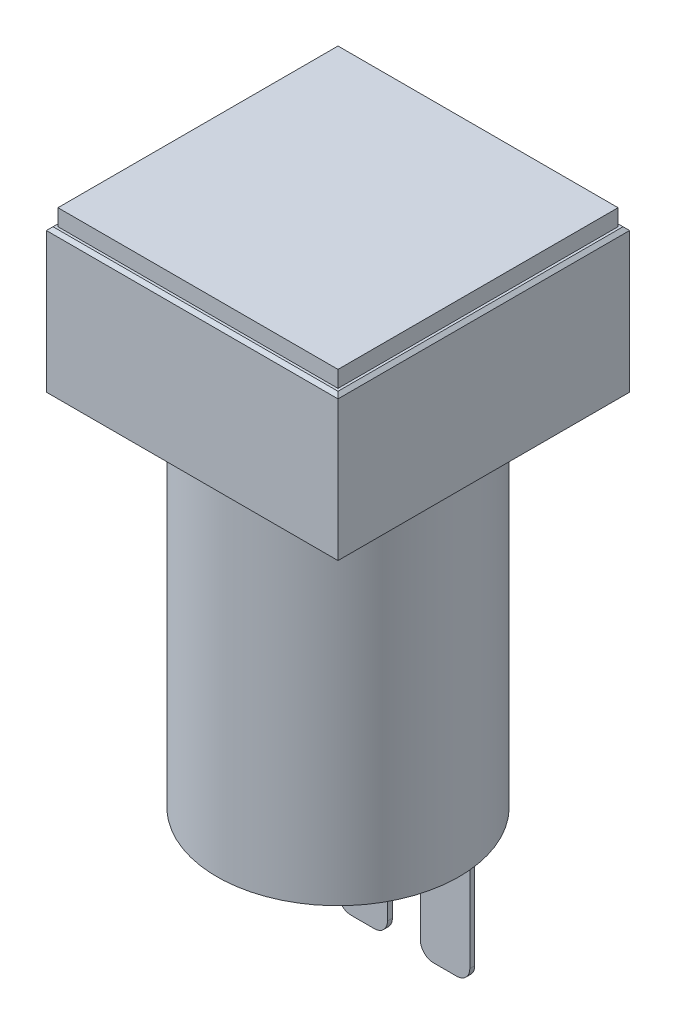
ISO-10303-21;
HEADER;
FILE_DESCRIPTION(('STEP AP214'),'2;1');
FILE_NAME('part.step','',(''),(''),'','','');
FILE_SCHEMA(('AUTOMOTIVE_DESIGN { 1 0 10303 214 1 1 1 1 }'));
ENDSEC;
DATA;
#1=APPLICATION_CONTEXT('core data for automotive mechanical design processes');
#2=APPLICATION_PROTOCOL_DEFINITION('international standard','automotive_design',2000,#1);
#3=PRODUCT_CONTEXT('',#1,'mechanical');
#4=PRODUCT('Part','Part','',(#3));
#5=PRODUCT_RELATED_PRODUCT_CATEGORY('part','',(#4));
#6=PRODUCT_DEFINITION_FORMATION('','',#4);
#7=PRODUCT_DEFINITION_CONTEXT('part definition',#1,'design');
#8=PRODUCT_DEFINITION('design','',#6,#7);
#9=PRODUCT_DEFINITION_SHAPE('','',#8);
#10=(LENGTH_UNIT() NAMED_UNIT(*) SI_UNIT(.MILLI.,.METRE.));
#11=(NAMED_UNIT(*) PLANE_ANGLE_UNIT() SI_UNIT($,.RADIAN.));
#12=(NAMED_UNIT(*) SI_UNIT($,.STERADIAN.) SOLID_ANGLE_UNIT());
#13=UNCERTAINTY_MEASURE_WITH_UNIT(LENGTH_MEASURE(1.E-05),#10,'distance_accuracy_value','');
#14=(GEOMETRIC_REPRESENTATION_CONTEXT(3) GLOBAL_UNCERTAINTY_ASSIGNED_CONTEXT((#13)) GLOBAL_UNIT_ASSIGNED_CONTEXT((#10,
#11,#12)) REPRESENTATION_CONTEXT('',''));
#15=CARTESIAN_POINT('',(0.,0.,0.));
#16=DIRECTION('',(0.,0.,1.));
#17=DIRECTION('',(1.,0.,0.));
#18=AXIS2_PLACEMENT_3D('',#15,#16,#17);
#19=CARTESIAN_POINT('',(0.,-21.8,0.));
#20=DIRECTION('',(0.,-1.,0.));
#21=DIRECTION('',(0.,0.,-1.));
#22=AXIS2_PLACEMENT_3D('',#19,#20,#21);
#23=PLANE('',#22);
#24=CARTESIAN_POINT('',(0.,-21.8,0.));
#25=DIRECTION('',(0.,-1.,0.));
#26=DIRECTION('',(0.,0.,-1.));
#27=AXIS2_PLACEMENT_3D('',#24,#25,#26);
#28=CIRCLE('',#27,7.35);
#29=CARTESIAN_POINT('',(0.,-21.8,-7.35));
#30=VERTEX_POINT('',#29);
#31=EDGE_CURVE('E372',#30,#30,#28,.T.);
#32=ORIENTED_EDGE('',*,*,#31,.T.);
#33=EDGE_LOOP('',(#32));
#34=FACE_BOUND('',#33,.T.);
#35=DIRECTION('',(1.,0.,0.));
#36=VECTOR('',#35,1.);
#37=CARTESIAN_POINT('',(-6.5,-21.8,-1.8));
#38=LINE('',#37,#36);
#39=CARTESIAN_POINT('',(-6.5,-21.8,-1.8));
#40=VERTEX_POINT('',#39);
#41=CARTESIAN_POINT('',(-3.5,-21.8,-1.8));
#42=VERTEX_POINT('',#41);
#43=EDGE_CURVE('E350',#40,#42,#38,.T.);
#44=ORIENTED_EDGE('',*,*,#43,.F.);
#45=DIRECTION('',(0.,0.,-1.));
#46=VECTOR('',#45,1.);
#47=CARTESIAN_POINT('',(-6.5,-21.8,-1.5));
#48=LINE('',#47,#46);
#49=CARTESIAN_POINT('',(-6.5,-21.8,-1.5));
#50=VERTEX_POINT('',#49);
#51=EDGE_CURVE('E336',#50,#40,#48,.T.);
#52=ORIENTED_EDGE('',*,*,#51,.F.);
#53=DIRECTION('',(-1.,0.,0.));
#54=VECTOR('',#53,1.);
#55=CARTESIAN_POINT('',(-6.5,-21.8,-1.5));
#56=LINE('',#55,#54);
#57=CARTESIAN_POINT('',(-3.5,-21.8,-1.5));
#58=VERTEX_POINT('',#57);
#59=EDGE_CURVE('E342',#58,#50,#56,.T.);
#60=ORIENTED_EDGE('',*,*,#59,.F.);
#61=DIRECTION('',(0.,0.,1.));
#62=VECTOR('',#61,1.);
#63=CARTESIAN_POINT('',(-3.5,-21.8,-1.5));
#64=LINE('',#63,#62);
#65=EDGE_CURVE('E354',#42,#58,#64,.T.);
#66=ORIENTED_EDGE('',*,*,#65,.F.);
#67=EDGE_LOOP('',(#44,#52,#60,#66));
#68=FACE_BOUND('',#67,.T.);
#69=DIRECTION('',(1.,0.,0.));
#70=VECTOR('',#69,1.);
#71=CARTESIAN_POINT('',(-1.5,-21.8,-1.8));
#72=LINE('',#71,#70);
#73=CARTESIAN_POINT('',(-1.5,-21.8,-1.8));
#74=VERTEX_POINT('',#73);
#75=CARTESIAN_POINT('',(1.5,-21.8,-1.8));
#76=VERTEX_POINT('',#75);
#77=EDGE_CURVE('E314',#74,#76,#72,.T.);
#78=ORIENTED_EDGE('',*,*,#77,.F.);
#79=DIRECTION('',(0.,0.,-1.));
#80=VECTOR('',#79,1.);
#81=CARTESIAN_POINT('',(-1.5,-21.8,-1.8));
#82=LINE('',#81,#80);
#83=CARTESIAN_POINT('',(-1.5,-21.8,-1.5));
#84=VERTEX_POINT('',#83);
#85=EDGE_CURVE('E300',#84,#74,#82,.T.);
#86=ORIENTED_EDGE('',*,*,#85,.F.);
#87=DIRECTION('',(-1.,0.,0.));
#88=VECTOR('',#87,1.);
#89=CARTESIAN_POINT('',(-1.5,-21.8,-1.5));
#90=LINE('',#89,#88);
#91=CARTESIAN_POINT('',(1.5,-21.8,-1.5));
#92=VERTEX_POINT('',#91);
#93=EDGE_CURVE('E306',#92,#84,#90,.T.);
#94=ORIENTED_EDGE('',*,*,#93,.F.);
#95=DIRECTION('',(0.,0.,1.));
#96=VECTOR('',#95,1.);
#97=CARTESIAN_POINT('',(1.5,-21.8,-1.8));
#98=LINE('',#97,#96);
#99=EDGE_CURVE('E318',#76,#92,#98,.T.);
#100=ORIENTED_EDGE('',*,*,#99,.F.);
#101=EDGE_LOOP('',(#78,#86,#94,#100));
#102=FACE_BOUND('',#101,.T.);
#103=DIRECTION('',(1.,0.,0.));
#104=VECTOR('',#103,1.);
#105=CARTESIAN_POINT('',(3.5,-21.8,-1.8));
#106=LINE('',#105,#104);
#107=CARTESIAN_POINT('',(3.5,-21.8,-1.8));
#108=VERTEX_POINT('',#107);
#109=CARTESIAN_POINT('',(6.5,-21.8,-1.8));
#110=VERTEX_POINT('',#109);
#111=EDGE_CURVE('E263',#108,#110,#106,.T.);
#112=ORIENTED_EDGE('',*,*,#111,.F.);
#113=DIRECTION('',(0.,0.,-1.));
#114=VECTOR('',#113,1.);
#115=CARTESIAN_POINT('',(3.5,-21.8,-1.5));
#116=LINE('',#115,#114);
#117=CARTESIAN_POINT('',(3.5,-21.8,-1.5));
#118=VERTEX_POINT('',#117);
#119=EDGE_CURVE('E258',#118,#108,#116,.T.);
#120=ORIENTED_EDGE('',*,*,#119,.F.);
#121=DIRECTION('',(-1.,0.,0.));
#122=VECTOR('',#121,1.);
#123=CARTESIAN_POINT('',(3.5,-21.8,-1.5));
#124=LINE('',#123,#122);
#125=CARTESIAN_POINT('',(6.5,-21.8,-1.5));
#126=VERTEX_POINT('',#125);
#127=EDGE_CURVE('E274',#126,#118,#124,.T.);
#128=ORIENTED_EDGE('',*,*,#127,.F.);
#129=DIRECTION('',(0.,0.,1.));
#130=VECTOR('',#129,1.);
#131=CARTESIAN_POINT('',(6.5,-21.8,-1.5));
#132=LINE('',#131,#130);
#133=EDGE_CURVE('E282',#110,#126,#132,.T.);
#134=ORIENTED_EDGE('',*,*,#133,.F.);
#135=EDGE_LOOP('',(#112,#120,#128,#134));
#136=FACE_BOUND('',#135,.T.);
#137=ADVANCED_FACE('F43',(#34,#68,#102,#136),#23,.T.);
#138=CARTESIAN_POINT('',(8.85,8.7,-8.85));
#139=DIRECTION('',(-1.,0.,0.));
#140=DIRECTION('',(0.,0.,1.));
#141=AXIS2_PLACEMENT_3D('',#138,#139,#140);
#142=PLANE('',#141);
#143=DIRECTION('',(0.,-1.,0.));
#144=VECTOR('',#143,1.);
#145=CARTESIAN_POINT('',(8.85,8.7,-8.85));
#146=LINE('',#145,#144);
#147=CARTESIAN_POINT('',(8.85,8.5,-8.85));
#148=VERTEX_POINT('',#147);
#149=CARTESIAN_POINT('',(8.85,0.,-8.85));
#150=VERTEX_POINT('',#149);
#151=EDGE_CURVE('E382',#148,#150,#146,.T.);
#152=ORIENTED_EDGE('',*,*,#151,.F.);
#153=DIRECTION('',(0.,0.,1.));
#154=VECTOR('',#153,1.);
#155=CARTESIAN_POINT('',(8.85,8.5,8.85));
#156=LINE('',#155,#154);
#157=CARTESIAN_POINT('',(8.85,8.5,8.85));
#158=VERTEX_POINT('',#157);
#159=EDGE_CURVE('E503',#148,#158,#156,.T.);
#160=ORIENTED_EDGE('',*,*,#159,.T.);
#161=DIRECTION('',(0.,-1.,0.));
#162=VECTOR('',#161,1.);
#163=CARTESIAN_POINT('',(8.85,8.7,8.85));
#164=LINE('',#163,#162);
#165=CARTESIAN_POINT('',(8.85,0.,8.85));
#166=VERTEX_POINT('',#165);
#167=EDGE_CURVE('E398',#158,#166,#164,.T.);
#168=ORIENTED_EDGE('',*,*,#167,.T.);
#169=DIRECTION('',(0.,0.,-1.));
#170=VECTOR('',#169,1.);
#171=CARTESIAN_POINT('',(8.85,0.,-8.85));
#172=LINE('',#171,#170);
#173=EDGE_CURVE('E376',#166,#150,#172,.T.);
#174=ORIENTED_EDGE('',*,*,#173,.T.);
#175=EDGE_LOOP('',(#152,#160,#168,#174));
#176=FACE_BOUND('',#175,.T.);
#177=ADVANCED_FACE('F568',(#176),#142,.F.);
#178=CARTESIAN_POINT('',(-8.85,8.7,-8.85));
#179=DIRECTION('',(0.,0.,1.));
#180=DIRECTION('',(1.,0.,0.));
#181=AXIS2_PLACEMENT_3D('',#178,#179,#180);
#182=PLANE('',#181);
#183=DIRECTION('',(0.,-1.,0.));
#184=VECTOR('',#183,1.);
#185=CARTESIAN_POINT('',(-8.85,8.7,-8.85));
#186=LINE('',#185,#184);
#187=CARTESIAN_POINT('',(-8.85,8.5,-8.85));
#188=VERTEX_POINT('',#187);
#189=CARTESIAN_POINT('',(-8.85,0.,-8.85));
#190=VERTEX_POINT('',#189);
#191=EDGE_CURVE('E404',#188,#190,#186,.T.);
#192=ORIENTED_EDGE('',*,*,#191,.F.);
#193=DIRECTION('',(1.,0.,0.));
#194=VECTOR('',#193,1.);
#195=CARTESIAN_POINT('',(8.85,8.5,-8.85));
#196=LINE('',#195,#194);
#197=EDGE_CURVE('E54',#188,#148,#196,.T.);
#198=ORIENTED_EDGE('',*,*,#197,.T.);
#199=ORIENTED_EDGE('',*,*,#151,.T.);
#200=DIRECTION('',(-1.,0.,0.));
#201=VECTOR('',#200,1.);
#202=CARTESIAN_POINT('',(-8.85,0.,-8.85));
#203=LINE('',#202,#201);
#204=EDGE_CURVE('E386',#150,#190,#203,.T.);
#205=ORIENTED_EDGE('',*,*,#204,.T.);
#206=EDGE_LOOP('',(#192,#198,#199,#205));
#207=FACE_BOUND('',#206,.T.);
#208=ADVANCED_FACE('F574',(#207),#182,.F.);
#209=CARTESIAN_POINT('',(-8.85,8.7,-8.85));
#210=DIRECTION('',(1.,0.,0.));
#211=DIRECTION('',(0.,0.,-1.));
#212=AXIS2_PLACEMENT_3D('',#209,#210,#211);
#213=PLANE('',#212);
#214=DIRECTION('',(0.,-1.,0.));
#215=VECTOR('',#214,1.);
#216=CARTESIAN_POINT('',(-8.85,8.7,8.85));
#217=LINE('',#216,#215);
#218=CARTESIAN_POINT('',(-8.85,8.5,8.85));
#219=VERTEX_POINT('',#218);
#220=CARTESIAN_POINT('',(-8.85,0.,8.85));
#221=VERTEX_POINT('',#220);
#222=EDGE_CURVE('E401',#219,#221,#217,.T.);
#223=ORIENTED_EDGE('',*,*,#222,.F.);
#224=DIRECTION('',(0.,0.,-1.));
#225=VECTOR('',#224,1.);
#226=CARTESIAN_POINT('',(-8.85,8.5,-8.85));
#227=LINE('',#226,#225);
#228=EDGE_CURVE('E11',#219,#188,#227,.T.);
#229=ORIENTED_EDGE('',*,*,#228,.T.);
#230=ORIENTED_EDGE('',*,*,#191,.T.);
#231=DIRECTION('',(0.,0.,1.));
#232=VECTOR('',#231,1.);
#233=CARTESIAN_POINT('',(-8.85,0.,-8.85));
#234=LINE('',#233,#232);
#235=EDGE_CURVE('E390',#190,#221,#234,.T.);
#236=ORIENTED_EDGE('',*,*,#235,.T.);
#237=EDGE_LOOP('',(#223,#229,#230,#236));
#238=FACE_BOUND('',#237,.T.);
#239=ADVANCED_FACE('F563',(#238),#213,.F.);
#240=CARTESIAN_POINT('',(-8.85,8.7,8.85));
#241=DIRECTION('',(0.,0.,-1.));
#242=DIRECTION('',(-1.,0.,0.));
#243=AXIS2_PLACEMENT_3D('',#240,#241,#242);
#244=PLANE('',#243);
#245=ORIENTED_EDGE('',*,*,#167,.F.);
#246=DIRECTION('',(-1.,0.,0.));
#247=VECTOR('',#246,1.);
#248=CARTESIAN_POINT('',(-8.85,8.5,8.85));
#249=LINE('',#248,#247);
#250=EDGE_CURVE('E499',#158,#219,#249,.T.);
#251=ORIENTED_EDGE('',*,*,#250,.T.);
#252=ORIENTED_EDGE('',*,*,#222,.T.);
#253=DIRECTION('',(1.,0.,0.));
#254=VECTOR('',#253,1.);
#255=CARTESIAN_POINT('',(-8.85,0.,8.85));
#256=LINE('',#255,#254);
#257=EDGE_CURVE('E394',#221,#166,#256,.T.);
#258=ORIENTED_EDGE('',*,*,#257,.T.);
#259=EDGE_LOOP('',(#245,#251,#252,#258));
#260=FACE_BOUND('',#259,.T.);
#261=ADVANCED_FACE('F553',(#260),#244,.F.);
#262=CARTESIAN_POINT('',(0.,8.7,0.));
#263=DIRECTION('',(0.,1.,0.));
#264=DIRECTION('',(0.,0.,1.));
#265=AXIS2_PLACEMENT_3D('',#262,#263,#264);
#266=PLANE('',#265);
#267=DIRECTION('',(0.,0.,1.));
#268=VECTOR('',#267,1.);
#269=CARTESIAN_POINT('',(-8.65,8.7,8.85));
#270=LINE('',#269,#268);
#271=CARTESIAN_POINT('',(-8.65,8.7,-8.65));
#272=VERTEX_POINT('',#271);
#273=CARTESIAN_POINT('',(-8.65,8.7,8.65));
#274=VERTEX_POINT('',#273);
#275=EDGE_CURVE('E486',#272,#274,#270,.T.);
#276=ORIENTED_EDGE('',*,*,#275,.T.);
#277=DIRECTION('',(1.,0.,0.));
#278=VECTOR('',#277,1.);
#279=CARTESIAN_POINT('',(8.85,8.7,8.65));
#280=LINE('',#279,#278);
#281=CARTESIAN_POINT('',(8.65,8.7,8.65));
#282=VERTEX_POINT('',#281);
#283=EDGE_CURVE('E495',#274,#282,#280,.T.);
#284=ORIENTED_EDGE('',*,*,#283,.T.);
#285=DIRECTION('',(0.,0.,-1.));
#286=VECTOR('',#285,1.);
#287=CARTESIAN_POINT('',(8.65,8.7,-8.85));
#288=LINE('',#287,#286);
#289=CARTESIAN_POINT('',(8.65,8.7,-8.65));
#290=VERTEX_POINT('',#289);
#291=EDGE_CURVE('E492',#282,#290,#288,.T.);
#292=ORIENTED_EDGE('',*,*,#291,.T.);
#293=DIRECTION('',(-1.,0.,0.));
#294=VECTOR('',#293,1.);
#295=CARTESIAN_POINT('',(-8.85,8.7,-8.65));
#296=LINE('',#295,#294);
#297=EDGE_CURVE('E489',#290,#272,#296,.T.);
#298=ORIENTED_EDGE('',*,*,#297,.T.);
#299=EDGE_LOOP('',(#276,#284,#292,#298));
#300=FACE_BOUND('',#299,.T.);
#301=DIRECTION('',(0.,0.,-1.));
#302=VECTOR('',#301,1.);
#303=CARTESIAN_POINT('',(8.5,8.7,-8.5));
#304=LINE('',#303,#302);
#305=CARTESIAN_POINT('',(8.5,8.7,8.5));
#306=VERTEX_POINT('',#305);
#307=CARTESIAN_POINT('',(8.5,8.7,-8.5));
#308=VERTEX_POINT('',#307);
#309=EDGE_CURVE('E256',#306,#308,#304,.T.);
#310=ORIENTED_EDGE('',*,*,#309,.F.);
#311=DIRECTION('',(1.,0.,0.));
#312=VECTOR('',#311,1.);
#313=CARTESIAN_POINT('',(-8.5,8.7,8.5));
#314=LINE('',#313,#312);
#315=CARTESIAN_POINT('',(-8.5,8.7,8.5));
#316=VERTEX_POINT('',#315);
#317=EDGE_CURVE('E253',#316,#306,#314,.T.);
#318=ORIENTED_EDGE('',*,*,#317,.F.);
#319=DIRECTION('',(0.,0.,1.));
#320=VECTOR('',#319,1.);
#321=CARTESIAN_POINT('',(-8.5,8.7,-8.5));
#322=LINE('',#321,#320);
#323=CARTESIAN_POINT('',(-8.5,8.7,-8.5));
#324=VERTEX_POINT('',#323);
#325=EDGE_CURVE('E529',#324,#316,#322,.T.);
#326=ORIENTED_EDGE('',*,*,#325,.F.);
#327=DIRECTION('',(-1.,0.,0.));
#328=VECTOR('',#327,1.);
#329=CARTESIAN_POINT('',(-8.5,8.7,-8.5));
#330=LINE('',#329,#328);
#331=EDGE_CURVE('E526',#308,#324,#330,.T.);
#332=ORIENTED_EDGE('',*,*,#331,.F.);
#333=EDGE_LOOP('',(#310,#318,#326,#332));
#334=FACE_BOUND('',#333,.T.);
#335=ADVANCED_FACE('F550',(#300,#334),#266,.T.);
#336=CARTESIAN_POINT('',(0.,0.,0.));
#337=DIRECTION('',(0.,1.,0.));
#338=DIRECTION('',(0.,0.,1.));
#339=AXIS2_PLACEMENT_3D('',#336,#337,#338);
#340=PLANE('',#339);
#341=CARTESIAN_POINT('',(0.,0.,0.));
#342=DIRECTION('',(0.,-1.,0.));
#343=DIRECTION('',(0.,0.,-1.));
#344=AXIS2_PLACEMENT_3D('',#341,#342,#343);
#345=CIRCLE('',#344,7.35);
#346=CARTESIAN_POINT('',(0.,0.,-7.35));
#347=VERTEX_POINT('',#346);
#348=EDGE_CURVE('E377',#347,#347,#345,.T.);
#349=ORIENTED_EDGE('',*,*,#348,.F.);
#350=EDGE_LOOP('',(#349));
#351=FACE_BOUND('',#350,.T.);
#352=ORIENTED_EDGE('',*,*,#173,.F.);
#353=ORIENTED_EDGE('',*,*,#257,.F.);
#354=ORIENTED_EDGE('',*,*,#235,.F.);
#355=ORIENTED_EDGE('',*,*,#204,.F.);
#356=EDGE_LOOP('',(#352,#353,#354,#355));
#357=FACE_BOUND('',#356,.T.);
#358=ADVANCED_FACE('F552',(#351,#357),#340,.F.);
#359=CARTESIAN_POINT('',(0.,-21.8,0.));
#360=DIRECTION('',(0.,1.,0.));
#361=DIRECTION('',(0.,0.,1.));
#362=AXIS2_PLACEMENT_3D('',#359,#360,#361);
#363=CYLINDRICAL_SURFACE('',#362,7.35);
#364=ORIENTED_EDGE('',*,*,#31,.F.);
#365=EDGE_LOOP('',(#364));
#366=FACE_BOUND('',#365,.T.);
#367=ORIENTED_EDGE('',*,*,#348,.T.);
#368=EDGE_LOOP('',(#367));
#369=FACE_BOUND('',#368,.T.);
#370=ADVANCED_FACE('F560',(#366,#369),#363,.T.);
#371=CARTESIAN_POINT('',(-6.5,-28.6,-1.5));
#372=DIRECTION('',(1.,0.,0.));
#373=DIRECTION('',(0.,0.,-1.));
#374=AXIS2_PLACEMENT_3D('',#371,#372,#373);
#375=PLANE('',#374);
#376=DIRECTION('',(0.,1.,0.));
#377=VECTOR('',#376,1.);
#378=CARTESIAN_POINT('',(-6.5,-28.6,-1.8));
#379=LINE('',#378,#377);
#380=CARTESIAN_POINT('',(-6.5,-27.8,-1.8));
#381=VERTEX_POINT('',#380);
#382=EDGE_CURVE('E369',#381,#40,#379,.T.);
#383=ORIENTED_EDGE('',*,*,#382,.F.);
#384=DIRECTION('',(0.,0.,-1.));
#385=VECTOR('',#384,1.);
#386=CARTESIAN_POINT('',(-6.5,-27.8,-1.5));
#387=LINE('',#386,#385);
#388=CARTESIAN_POINT('',(-6.5,-27.8,-1.5));
#389=VERTEX_POINT('',#388);
#390=EDGE_CURVE('E483',#381,#389,#387,.F.);
#391=ORIENTED_EDGE('',*,*,#390,.T.);
#392=DIRECTION('',(0.,1.,0.));
#393=VECTOR('',#392,1.);
#394=CARTESIAN_POINT('',(-6.5,-28.6,-1.5));
#395=LINE('',#394,#393);
#396=EDGE_CURVE('E346',#389,#50,#395,.T.);
#397=ORIENTED_EDGE('',*,*,#396,.T.);
#398=ORIENTED_EDGE('',*,*,#51,.T.);
#399=EDGE_LOOP('',(#383,#391,#397,#398));
#400=FACE_BOUND('',#399,.T.);
#401=ADVANCED_FACE('F579',(#400),#375,.F.);
#402=CARTESIAN_POINT('',(-6.5,-28.6,-1.8));
#403=DIRECTION('',(0.,0.,1.));
#404=DIRECTION('',(1.,0.,0.));
#405=AXIS2_PLACEMENT_3D('',#402,#403,#404);
#406=PLANE('',#405);
#407=DIRECTION('',(0.,1.,0.));
#408=VECTOR('',#407,1.);
#409=CARTESIAN_POINT('',(-3.5,-28.6,-1.8));
#410=LINE('',#409,#408);
#411=CARTESIAN_POINT('',(-3.5,-27.8,-1.8));
#412=VERTEX_POINT('',#411);
#413=EDGE_CURVE('E366',#412,#42,#410,.T.);
#414=ORIENTED_EDGE('',*,*,#413,.F.);
#415=CARTESIAN_POINT('',(-4.3,-27.8,-1.8));
#416=DIRECTION('',(0.,0.,1.));
#417=DIRECTION('',(1.,0.,0.));
#418=AXIS2_PLACEMENT_3D('',#415,#416,#417);
#419=CIRCLE('',#418,0.8);
#420=CARTESIAN_POINT('',(-4.3,-28.6,-1.8));
#421=VERTEX_POINT('',#420);
#422=EDGE_CURVE('E480',#412,#421,#419,.F.);
#423=ORIENTED_EDGE('',*,*,#422,.T.);
#424=DIRECTION('',(1.,0.,0.));
#425=VECTOR('',#424,1.);
#426=CARTESIAN_POINT('',(-6.5,-28.6,-1.8));
#427=LINE('',#426,#425);
#428=CARTESIAN_POINT('',(-5.7,-28.6,-1.8));
#429=VERTEX_POINT('',#428);
#430=EDGE_CURVE('E337',#429,#421,#427,.T.);
#431=ORIENTED_EDGE('',*,*,#430,.F.);
#432=CARTESIAN_POINT('',(-5.7,-27.8,-1.8));
#433=DIRECTION('',(0.,0.,1.));
#434=DIRECTION('',(1.,0.,0.));
#435=AXIS2_PLACEMENT_3D('',#432,#433,#434);
#436=CIRCLE('',#435,0.8);
#437=EDGE_CURVE('E477',#429,#381,#436,.F.);
#438=ORIENTED_EDGE('',*,*,#437,.T.);
#439=ORIENTED_EDGE('',*,*,#382,.T.);
#440=ORIENTED_EDGE('',*,*,#43,.T.);
#441=EDGE_LOOP('',(#414,#423,#431,#438,#439,#440));
#442=FACE_BOUND('',#441,.T.);
#443=ADVANCED_FACE('F586',(#442),#406,.F.);
#444=CARTESIAN_POINT('',(-3.5,-28.6,-1.5));
#445=DIRECTION('',(-1.,0.,0.));
#446=DIRECTION('',(0.,0.,1.));
#447=AXIS2_PLACEMENT_3D('',#444,#445,#446);
#448=PLANE('',#447);
#449=DIRECTION('',(0.,1.,0.));
#450=VECTOR('',#449,1.);
#451=CARTESIAN_POINT('',(-3.5,-28.6,-1.5));
#452=LINE('',#451,#450);
#453=CARTESIAN_POINT('',(-3.5,-27.8,-1.5));
#454=VERTEX_POINT('',#453);
#455=EDGE_CURVE('E363',#454,#58,#452,.T.);
#456=ORIENTED_EDGE('',*,*,#455,.F.);
#457=DIRECTION('',(0.,0.,1.));
#458=VECTOR('',#457,1.);
#459=CARTESIAN_POINT('',(-3.5,-27.8,-1.8));
#460=LINE('',#459,#458);
#461=EDGE_CURVE('E474',#454,#412,#460,.F.);
#462=ORIENTED_EDGE('',*,*,#461,.T.);
#463=ORIENTED_EDGE('',*,*,#413,.T.);
#464=ORIENTED_EDGE('',*,*,#65,.T.);
#465=EDGE_LOOP('',(#456,#462,#463,#464));
#466=FACE_BOUND('',#465,.T.);
#467=ADVANCED_FACE('F716',(#466),#448,.F.);
#468=CARTESIAN_POINT('',(-6.5,-28.6,-1.5));
#469=DIRECTION('',(0.,0.,-1.));
#470=DIRECTION('',(-1.,0.,0.));
#471=AXIS2_PLACEMENT_3D('',#468,#469,#470);
#472=PLANE('',#471);
#473=DIRECTION('',(-1.,0.,0.));
#474=VECTOR('',#473,1.);
#475=CARTESIAN_POINT('',(-6.5,-28.6,-1.5));
#476=LINE('',#475,#474);
#477=CARTESIAN_POINT('',(-4.3,-28.6,-1.5));
#478=VERTEX_POINT('',#477);
#479=CARTESIAN_POINT('',(-5.7,-28.6,-1.5));
#480=VERTEX_POINT('',#479);
#481=EDGE_CURVE('E341',#478,#480,#476,.T.);
#482=ORIENTED_EDGE('',*,*,#481,.F.);
#483=CARTESIAN_POINT('',(-4.3,-27.8,-1.5));
#484=DIRECTION('',(0.,0.,-1.));
#485=DIRECTION('',(-1.,0.,0.));
#486=AXIS2_PLACEMENT_3D('',#483,#484,#485);
#487=CIRCLE('',#486,0.8);
#488=EDGE_CURVE('E471',#478,#454,#487,.F.);
#489=ORIENTED_EDGE('',*,*,#488,.T.);
#490=ORIENTED_EDGE('',*,*,#455,.T.);
#491=ORIENTED_EDGE('',*,*,#59,.T.);
#492=ORIENTED_EDGE('',*,*,#396,.F.);
#493=CARTESIAN_POINT('',(-5.7,-27.8,-1.5));
#494=DIRECTION('',(0.,0.,-1.));
#495=DIRECTION('',(-1.,0.,0.));
#496=AXIS2_PLACEMENT_3D('',#493,#494,#495);
#497=CIRCLE('',#496,0.8);
#498=EDGE_CURVE('E468',#389,#480,#497,.F.);
#499=ORIENTED_EDGE('',*,*,#498,.T.);
#500=EDGE_LOOP('',(#482,#489,#490,#491,#492,#499));
#501=FACE_BOUND('',#500,.T.);
#502=ADVANCED_FACE('F712',(#501),#472,.F.);
#503=CARTESIAN_POINT('',(0.,-28.6,0.));
#504=DIRECTION('',(0.,-1.,0.));
#505=DIRECTION('',(0.,0.,-1.));
#506=AXIS2_PLACEMENT_3D('',#503,#504,#505);
#507=PLANE('',#506);
#508=ORIENTED_EDGE('',*,*,#430,.T.);
#509=DIRECTION('',(0.,0.,1.));
#510=VECTOR('',#509,1.);
#511=CARTESIAN_POINT('',(-4.3,-28.6,-1.5));
#512=LINE('',#511,#510);
#513=EDGE_CURVE('E464',#421,#478,#512,.T.);
#514=ORIENTED_EDGE('',*,*,#513,.T.);
#515=ORIENTED_EDGE('',*,*,#481,.T.);
#516=DIRECTION('',(0.,0.,-1.));
#517=VECTOR('',#516,1.);
#518=CARTESIAN_POINT('',(-5.7,-28.6,-1.8));
#519=LINE('',#518,#517);
#520=EDGE_CURVE('E460',#480,#429,#519,.T.);
#521=ORIENTED_EDGE('',*,*,#520,.T.);
#522=EDGE_LOOP('',(#508,#514,#515,#521));
#523=FACE_BOUND('',#522,.T.);
#524=ADVANCED_FACE('F708',(#523),#507,.T.);
#525=CARTESIAN_POINT('',(-1.5,-28.6,-1.8));
#526=DIRECTION('',(1.,0.,0.));
#527=DIRECTION('',(0.,0.,-1.));
#528=AXIS2_PLACEMENT_3D('',#525,#526,#527);
#529=PLANE('',#528);
#530=DIRECTION('',(0.,1.,0.));
#531=VECTOR('',#530,1.);
#532=CARTESIAN_POINT('',(-1.5,-28.6,-1.8));
#533=LINE('',#532,#531);
#534=CARTESIAN_POINT('',(-1.5,-27.8,-1.8));
#535=VERTEX_POINT('',#534);
#536=EDGE_CURVE('E333',#535,#74,#533,.T.);
#537=ORIENTED_EDGE('',*,*,#536,.F.);
#538=DIRECTION('',(0.,0.,-1.));
#539=VECTOR('',#538,1.);
#540=CARTESIAN_POINT('',(-1.5,-27.8,-1.8));
#541=LINE('',#540,#539);
#542=CARTESIAN_POINT('',(-1.5,-27.8,-1.5));
#543=VERTEX_POINT('',#542);
#544=EDGE_CURVE('E457',#535,#543,#541,.F.);
#545=ORIENTED_EDGE('',*,*,#544,.T.);
#546=DIRECTION('',(0.,1.,0.));
#547=VECTOR('',#546,1.);
#548=CARTESIAN_POINT('',(-1.5,-28.6,-1.5));
#549=LINE('',#548,#547);
#550=EDGE_CURVE('E310',#543,#84,#549,.T.);
#551=ORIENTED_EDGE('',*,*,#550,.T.);
#552=ORIENTED_EDGE('',*,*,#85,.T.);
#553=EDGE_LOOP('',(#537,#545,#551,#552));
#554=FACE_BOUND('',#553,.T.);
#555=ADVANCED_FACE('F704',(#554),#529,.F.);
#556=CARTESIAN_POINT('',(-1.5,-28.6,-1.8));
#557=DIRECTION('',(0.,0.,1.));
#558=DIRECTION('',(1.,0.,0.));
#559=AXIS2_PLACEMENT_3D('',#556,#557,#558);
#560=PLANE('',#559);
#561=DIRECTION('',(0.,1.,0.));
#562=VECTOR('',#561,1.);
#563=CARTESIAN_POINT('',(1.5,-28.6,-1.8));
#564=LINE('',#563,#562);
#565=CARTESIAN_POINT('',(1.5,-27.8,-1.8));
#566=VERTEX_POINT('',#565);
#567=EDGE_CURVE('E330',#566,#76,#564,.T.);
#568=ORIENTED_EDGE('',*,*,#567,.F.);
#569=CARTESIAN_POINT('',(0.7,-27.8,-1.8));
#570=DIRECTION('',(0.,0.,1.));
#571=DIRECTION('',(1.,0.,0.));
#572=AXIS2_PLACEMENT_3D('',#569,#570,#571);
#573=CIRCLE('',#572,0.8);
#574=CARTESIAN_POINT('',(0.700000000000001,-28.6,-1.8));
#575=VERTEX_POINT('',#574);
#576=EDGE_CURVE('E454',#566,#575,#573,.F.);
#577=ORIENTED_EDGE('',*,*,#576,.T.);
#578=DIRECTION('',(1.,0.,0.));
#579=VECTOR('',#578,1.);
#580=CARTESIAN_POINT('',(-1.5,-28.6,-1.8));
#581=LINE('',#580,#579);
#582=CARTESIAN_POINT('',(-0.7,-28.6,-1.8));
#583=VERTEX_POINT('',#582);
#584=EDGE_CURVE('E301',#583,#575,#581,.T.);
#585=ORIENTED_EDGE('',*,*,#584,.F.);
#586=CARTESIAN_POINT('',(-0.7,-27.8,-1.8));
#587=DIRECTION('',(0.,0.,1.));
#588=DIRECTION('',(1.,0.,0.));
#589=AXIS2_PLACEMENT_3D('',#586,#587,#588);
#590=CIRCLE('',#589,0.8);
#591=EDGE_CURVE('E451',#583,#535,#590,.F.);
#592=ORIENTED_EDGE('',*,*,#591,.T.);
#593=ORIENTED_EDGE('',*,*,#536,.T.);
#594=ORIENTED_EDGE('',*,*,#77,.T.);
#595=EDGE_LOOP('',(#568,#577,#585,#592,#593,#594));
#596=FACE_BOUND('',#595,.T.);
#597=ADVANCED_FACE('F700',(#596),#560,.F.);
#598=CARTESIAN_POINT('',(1.5,-28.6,-1.8));
#599=DIRECTION('',(-1.,0.,0.));
#600=DIRECTION('',(0.,0.,1.));
#601=AXIS2_PLACEMENT_3D('',#598,#599,#600);
#602=PLANE('',#601);
#603=DIRECTION('',(0.,1.,0.));
#604=VECTOR('',#603,1.);
#605=CARTESIAN_POINT('',(1.5,-28.6,-1.5));
#606=LINE('',#605,#604);
#607=CARTESIAN_POINT('',(1.5,-27.8,-1.5));
#608=VERTEX_POINT('',#607);
#609=EDGE_CURVE('E327',#608,#92,#606,.T.);
#610=ORIENTED_EDGE('',*,*,#609,.F.);
#611=DIRECTION('',(0.,0.,1.));
#612=VECTOR('',#611,1.);
#613=CARTESIAN_POINT('',(1.5,-27.8,-1.8));
#614=LINE('',#613,#612);
#615=EDGE_CURVE('E448',#608,#566,#614,.F.);
#616=ORIENTED_EDGE('',*,*,#615,.T.);
#617=ORIENTED_EDGE('',*,*,#567,.T.);
#618=ORIENTED_EDGE('',*,*,#99,.T.);
#619=EDGE_LOOP('',(#610,#616,#617,#618));
#620=FACE_BOUND('',#619,.T.);
#621=ADVANCED_FACE('F696',(#620),#602,.F.);
#622=CARTESIAN_POINT('',(-1.5,-28.6,-1.5));
#623=DIRECTION('',(0.,0.,-1.));
#624=DIRECTION('',(-1.,0.,0.));
#625=AXIS2_PLACEMENT_3D('',#622,#623,#624);
#626=PLANE('',#625);
#627=DIRECTION('',(-1.,0.,0.));
#628=VECTOR('',#627,1.);
#629=CARTESIAN_POINT('',(-1.5,-28.6,-1.5));
#630=LINE('',#629,#628);
#631=CARTESIAN_POINT('',(0.7,-28.6,-1.5));
#632=VERTEX_POINT('',#631);
#633=CARTESIAN_POINT('',(-0.7,-28.6,-1.5));
#634=VERTEX_POINT('',#633);
#635=EDGE_CURVE('E305',#632,#634,#630,.T.);
#636=ORIENTED_EDGE('',*,*,#635,.F.);
#637=CARTESIAN_POINT('',(0.7,-27.8,-1.5));
#638=DIRECTION('',(0.,0.,-1.));
#639=DIRECTION('',(-1.,0.,0.));
#640=AXIS2_PLACEMENT_3D('',#637,#638,#639);
#641=CIRCLE('',#640,0.8);
#642=EDGE_CURVE('E445',#632,#608,#641,.F.);
#643=ORIENTED_EDGE('',*,*,#642,.T.);
#644=ORIENTED_EDGE('',*,*,#609,.T.);
#645=ORIENTED_EDGE('',*,*,#93,.T.);
#646=ORIENTED_EDGE('',*,*,#550,.F.);
#647=CARTESIAN_POINT('',(-0.7,-27.8,-1.5));
#648=DIRECTION('',(0.,0.,-1.));
#649=DIRECTION('',(-1.,0.,0.));
#650=AXIS2_PLACEMENT_3D('',#647,#648,#649);
#651=CIRCLE('',#650,0.8);
#652=EDGE_CURVE('E442',#543,#634,#651,.F.);
#653=ORIENTED_EDGE('',*,*,#652,.T.);
#654=EDGE_LOOP('',(#636,#643,#644,#645,#646,#653));
#655=FACE_BOUND('',#654,.T.);
#656=ADVANCED_FACE('F692',(#655),#626,.F.);
#657=CARTESIAN_POINT('',(0.,-28.6,0.));
#658=DIRECTION('',(0.,1.,0.));
#659=DIRECTION('',(0.,0.,1.));
#660=AXIS2_PLACEMENT_3D('',#657,#658,#659);
#661=PLANE('',#660);
#662=ORIENTED_EDGE('',*,*,#584,.T.);
#663=DIRECTION('',(0.,0.,1.));
#664=VECTOR('',#663,1.);
#665=CARTESIAN_POINT('',(0.7,-28.6,0.));
#666=LINE('',#665,#664);
#667=EDGE_CURVE('E438',#575,#632,#666,.T.);
#668=ORIENTED_EDGE('',*,*,#667,.T.);
#669=ORIENTED_EDGE('',*,*,#635,.T.);
#670=DIRECTION('',(0.,0.,-1.));
#671=VECTOR('',#670,1.);
#672=CARTESIAN_POINT('',(-0.700000000000002,-28.6,0.));
#673=LINE('',#672,#671);
#674=EDGE_CURVE('E434',#634,#583,#673,.T.);
#675=ORIENTED_EDGE('',*,*,#674,.T.);
#676=EDGE_LOOP('',(#662,#668,#669,#675));
#677=FACE_BOUND('',#676,.T.);
#678=ADVANCED_FACE('F688',(#677),#661,.F.);
#679=CARTESIAN_POINT('',(3.5,-28.6,-1.5));
#680=DIRECTION('',(1.,0.,0.));
#681=DIRECTION('',(0.,0.,-1.));
#682=AXIS2_PLACEMENT_3D('',#679,#680,#681);
#683=PLANE('',#682);
#684=DIRECTION('',(0.,1.,0.));
#685=VECTOR('',#684,1.);
#686=CARTESIAN_POINT('',(3.5,-28.6,-1.8));
#687=LINE('',#686,#685);
#688=CARTESIAN_POINT('',(3.5,-27.8,-1.8));
#689=VERTEX_POINT('',#688);
#690=EDGE_CURVE('E297',#689,#108,#687,.T.);
#691=ORIENTED_EDGE('',*,*,#690,.F.);
#692=DIRECTION('',(0.,0.,-1.));
#693=VECTOR('',#692,1.);
#694=CARTESIAN_POINT('',(3.5,-27.8,-1.5));
#695=LINE('',#694,#693);
#696=CARTESIAN_POINT('',(3.5,-27.8,-1.5));
#697=VERTEX_POINT('',#696);
#698=EDGE_CURVE('E431',#689,#697,#695,.F.);
#699=ORIENTED_EDGE('',*,*,#698,.T.);
#700=DIRECTION('',(0.,1.,0.));
#701=VECTOR('',#700,1.);
#702=CARTESIAN_POINT('',(3.5,-28.6,-1.5));
#703=LINE('',#702,#701);
#704=EDGE_CURVE('E277',#697,#118,#703,.T.);
#705=ORIENTED_EDGE('',*,*,#704,.T.);
#706=ORIENTED_EDGE('',*,*,#119,.T.);
#707=EDGE_LOOP('',(#691,#699,#705,#706));
#708=FACE_BOUND('',#707,.T.);
#709=ADVANCED_FACE('F684',(#708),#683,.F.);
#710=CARTESIAN_POINT('',(3.5,-28.6,-1.8));
#711=DIRECTION('',(0.,0.,1.));
#712=DIRECTION('',(1.,0.,0.));
#713=AXIS2_PLACEMENT_3D('',#710,#711,#712);
#714=PLANE('',#713);
#715=DIRECTION('',(0.,1.,0.));
#716=VECTOR('',#715,1.);
#717=CARTESIAN_POINT('',(6.5,-28.6,-1.8));
#718=LINE('',#717,#716);
#719=CARTESIAN_POINT('',(6.5,-27.8,-1.8));
#720=VERTEX_POINT('',#719);
#721=EDGE_CURVE('E294',#720,#110,#718,.T.);
#722=ORIENTED_EDGE('',*,*,#721,.F.);
#723=CARTESIAN_POINT('',(5.7,-27.8,-1.8));
#724=DIRECTION('',(0.,0.,1.));
#725=DIRECTION('',(1.,0.,0.));
#726=AXIS2_PLACEMENT_3D('',#723,#724,#725);
#727=CIRCLE('',#726,0.8);
#728=CARTESIAN_POINT('',(5.7,-28.6,-1.8));
#729=VERTEX_POINT('',#728);
#730=EDGE_CURVE('E428',#720,#729,#727,.F.);
#731=ORIENTED_EDGE('',*,*,#730,.T.);
#732=DIRECTION('',(1.,0.,0.));
#733=VECTOR('',#732,1.);
#734=CARTESIAN_POINT('',(3.5,-28.6,-1.8));
#735=LINE('',#734,#733);
#736=CARTESIAN_POINT('',(4.3,-28.6,-1.8));
#737=VERTEX_POINT('',#736);
#738=EDGE_CURVE('E269',#737,#729,#735,.T.);
#739=ORIENTED_EDGE('',*,*,#738,.F.);
#740=CARTESIAN_POINT('',(4.3,-27.8,-1.8));
#741=DIRECTION('',(0.,0.,1.));
#742=DIRECTION('',(1.,0.,0.));
#743=AXIS2_PLACEMENT_3D('',#740,#741,#742);
#744=CIRCLE('',#743,0.8);
#745=EDGE_CURVE('E425',#737,#689,#744,.F.);
#746=ORIENTED_EDGE('',*,*,#745,.T.);
#747=ORIENTED_EDGE('',*,*,#690,.T.);
#748=ORIENTED_EDGE('',*,*,#111,.T.);
#749=EDGE_LOOP('',(#722,#731,#739,#746,#747,#748));
#750=FACE_BOUND('',#749,.T.);
#751=ADVANCED_FACE('F680',(#750),#714,.F.);
#752=CARTESIAN_POINT('',(6.5,-28.6,-1.5));
#753=DIRECTION('',(-1.,0.,0.));
#754=DIRECTION('',(0.,0.,1.));
#755=AXIS2_PLACEMENT_3D('',#752,#753,#754);
#756=PLANE('',#755);
#757=DIRECTION('',(0.,1.,0.));
#758=VECTOR('',#757,1.);
#759=CARTESIAN_POINT('',(6.5,-28.6,-1.5));
#760=LINE('',#759,#758);
#761=CARTESIAN_POINT('',(6.5,-27.8,-1.5));
#762=VERTEX_POINT('',#761);
#763=EDGE_CURVE('E291',#762,#126,#760,.T.);
#764=ORIENTED_EDGE('',*,*,#763,.F.);
#765=DIRECTION('',(0.,0.,1.));
#766=VECTOR('',#765,1.);
#767=CARTESIAN_POINT('',(6.5,-27.8,-1.8));
#768=LINE('',#767,#766);
#769=EDGE_CURVE('E422',#762,#720,#768,.F.);
#770=ORIENTED_EDGE('',*,*,#769,.T.);
#771=ORIENTED_EDGE('',*,*,#721,.T.);
#772=ORIENTED_EDGE('',*,*,#133,.T.);
#773=EDGE_LOOP('',(#764,#770,#771,#772));
#774=FACE_BOUND('',#773,.T.);
#775=ADVANCED_FACE('F676',(#774),#756,.F.);
#776=CARTESIAN_POINT('',(3.5,-28.6,-1.5));
#777=DIRECTION('',(0.,0.,-1.));
#778=DIRECTION('',(-1.,0.,0.));
#779=AXIS2_PLACEMENT_3D('',#776,#777,#778);
#780=PLANE('',#779);
#781=DIRECTION('',(-1.,0.,0.));
#782=VECTOR('',#781,1.);
#783=CARTESIAN_POINT('',(3.5,-28.6,-1.5));
#784=LINE('',#783,#782);
#785=CARTESIAN_POINT('',(5.7,-28.6,-1.5));
#786=VERTEX_POINT('',#785);
#787=CARTESIAN_POINT('',(4.3,-28.6,-1.5));
#788=VERTEX_POINT('',#787);
#789=EDGE_CURVE('E273',#786,#788,#784,.T.);
#790=ORIENTED_EDGE('',*,*,#789,.F.);
#791=CARTESIAN_POINT('',(5.7,-27.8,-1.5));
#792=DIRECTION('',(0.,0.,-1.));
#793=DIRECTION('',(-1.,0.,0.));
#794=AXIS2_PLACEMENT_3D('',#791,#792,#793);
#795=CIRCLE('',#794,0.8);
#796=EDGE_CURVE('E419',#786,#762,#795,.F.);
#797=ORIENTED_EDGE('',*,*,#796,.T.);
#798=ORIENTED_EDGE('',*,*,#763,.T.);
#799=ORIENTED_EDGE('',*,*,#127,.T.);
#800=ORIENTED_EDGE('',*,*,#704,.F.);
#801=CARTESIAN_POINT('',(4.3,-27.8,-1.5));
#802=DIRECTION('',(0.,0.,-1.));
#803=DIRECTION('',(-1.,0.,0.));
#804=AXIS2_PLACEMENT_3D('',#801,#802,#803);
#805=CIRCLE('',#804,0.8);
#806=EDGE_CURVE('E416',#697,#788,#805,.F.);
#807=ORIENTED_EDGE('',*,*,#806,.T.);
#808=EDGE_LOOP('',(#790,#797,#798,#799,#800,#807));
#809=FACE_BOUND('',#808,.T.);
#810=ADVANCED_FACE('F672',(#809),#780,.F.);
#811=CARTESIAN_POINT('',(0.,-28.6,0.));
#812=DIRECTION('',(0.,-1.,0.));
#813=DIRECTION('',(0.,0.,-1.));
#814=AXIS2_PLACEMENT_3D('',#811,#812,#813);
#815=PLANE('',#814);
#816=ORIENTED_EDGE('',*,*,#738,.T.);
#817=DIRECTION('',(0.,0.,1.));
#818=VECTOR('',#817,1.);
#819=CARTESIAN_POINT('',(5.7,-28.6,-1.5));
#820=LINE('',#819,#818);
#821=EDGE_CURVE('E412',#729,#786,#820,.T.);
#822=ORIENTED_EDGE('',*,*,#821,.T.);
#823=ORIENTED_EDGE('',*,*,#789,.T.);
#824=DIRECTION('',(0.,0.,-1.));
#825=VECTOR('',#824,1.);
#826=CARTESIAN_POINT('',(4.3,-28.6,-1.8));
#827=LINE('',#826,#825);
#828=EDGE_CURVE('E381',#788,#737,#827,.T.);
#829=ORIENTED_EDGE('',*,*,#828,.T.);
#830=EDGE_LOOP('',(#816,#822,#823,#829));
#831=FACE_BOUND('',#830,.T.);
#832=ADVANCED_FACE('F609',(#831),#815,.T.);
#833=CARTESIAN_POINT('',(5.69999999999999,-27.8,0.));
#834=DIRECTION('',(0.,0.,-1.));
#835=DIRECTION('',(-1.,0.,0.));
#836=AXIS2_PLACEMENT_3D('',#833,#834,#835);
#837=CYLINDRICAL_SURFACE('',#836,0.8);
#838=ORIENTED_EDGE('',*,*,#730,.F.);
#839=ORIENTED_EDGE('',*,*,#769,.F.);
#840=ORIENTED_EDGE('',*,*,#796,.F.);
#841=ORIENTED_EDGE('',*,*,#821,.F.);
#842=EDGE_LOOP('',(#838,#839,#840,#841));
#843=FACE_BOUND('',#842,.T.);
#844=ADVANCED_FACE('F605',(#843),#837,.T.);
#845=CARTESIAN_POINT('',(4.3,-27.8,0.));
#846=DIRECTION('',(0.,0.,1.));
#847=DIRECTION('',(1.,0.,0.));
#848=AXIS2_PLACEMENT_3D('',#845,#846,#847);
#849=CYLINDRICAL_SURFACE('',#848,0.8);
#850=ORIENTED_EDGE('',*,*,#806,.F.);
#851=ORIENTED_EDGE('',*,*,#698,.F.);
#852=ORIENTED_EDGE('',*,*,#745,.F.);
#853=ORIENTED_EDGE('',*,*,#828,.F.);
#854=EDGE_LOOP('',(#850,#851,#852,#853));
#855=FACE_BOUND('',#854,.T.);
#856=ADVANCED_FACE('F608',(#855),#849,.T.);
#857=CARTESIAN_POINT('',(0.7,-27.8,0.));
#858=DIRECTION('',(0.,0.,1.));
#859=DIRECTION('',(1.,0.,0.));
#860=AXIS2_PLACEMENT_3D('',#857,#858,#859);
#861=CYLINDRICAL_SURFACE('',#860,0.8);
#862=ORIENTED_EDGE('',*,*,#576,.F.);
#863=ORIENTED_EDGE('',*,*,#615,.F.);
#864=ORIENTED_EDGE('',*,*,#642,.F.);
#865=ORIENTED_EDGE('',*,*,#667,.F.);
#866=EDGE_LOOP('',(#862,#863,#864,#865));
#867=FACE_BOUND('',#866,.T.);
#868=ADVANCED_FACE('F613',(#867),#861,.T.);
#869=CARTESIAN_POINT('',(-0.700000000000002,-27.8,0.));
#870=DIRECTION('',(0.,0.,-1.));
#871=DIRECTION('',(-1.,0.,0.));
#872=AXIS2_PLACEMENT_3D('',#869,#870,#871);
#873=CYLINDRICAL_SURFACE('',#872,0.8);
#874=ORIENTED_EDGE('',*,*,#652,.F.);
#875=ORIENTED_EDGE('',*,*,#544,.F.);
#876=ORIENTED_EDGE('',*,*,#591,.F.);
#877=ORIENTED_EDGE('',*,*,#674,.F.);
#878=EDGE_LOOP('',(#874,#875,#876,#877));
#879=FACE_BOUND('',#878,.T.);
#880=ADVANCED_FACE('F617',(#879),#873,.T.);
#881=CARTESIAN_POINT('',(-4.3,-27.8,0.));
#882=DIRECTION('',(0.,0.,-1.));
#883=DIRECTION('',(-1.,0.,0.));
#884=AXIS2_PLACEMENT_3D('',#881,#882,#883);
#885=CYLINDRICAL_SURFACE('',#884,0.8);
#886=ORIENTED_EDGE('',*,*,#422,.F.);
#887=ORIENTED_EDGE('',*,*,#461,.F.);
#888=ORIENTED_EDGE('',*,*,#488,.F.);
#889=ORIENTED_EDGE('',*,*,#513,.F.);
#890=EDGE_LOOP('',(#886,#887,#888,#889));
#891=FACE_BOUND('',#890,.T.);
#892=ADVANCED_FACE('F621',(#891),#885,.T.);
#893=CARTESIAN_POINT('',(-5.7,-27.8,0.));
#894=DIRECTION('',(0.,0.,1.));
#895=DIRECTION('',(1.,0.,0.));
#896=AXIS2_PLACEMENT_3D('',#893,#894,#895);
#897=CYLINDRICAL_SURFACE('',#896,0.8);
#898=ORIENTED_EDGE('',*,*,#498,.F.);
#899=ORIENTED_EDGE('',*,*,#390,.F.);
#900=ORIENTED_EDGE('',*,*,#437,.F.);
#901=ORIENTED_EDGE('',*,*,#520,.F.);
#902=EDGE_LOOP('',(#898,#899,#900,#901));
#903=FACE_BOUND('',#902,.T.);
#904=ADVANCED_FACE('F625',(#903),#897,.T.);
#905=CARTESIAN_POINT('',(8.5,9.7,-8.5));
#906=DIRECTION('',(-1.,0.,0.));
#907=DIRECTION('',(0.,0.,1.));
#908=AXIS2_PLACEMENT_3D('',#905,#906,#907);
#909=PLANE('',#908);
#910=ORIENTED_EDGE('',*,*,#309,.T.);
#911=DIRECTION('',(0.,-1.,0.));
#912=VECTOR('',#911,1.);
#913=CARTESIAN_POINT('',(8.5,9.7,-8.5));
#914=LINE('',#913,#912);
#915=CARTESIAN_POINT('',(8.5,9.7,-8.5));
#916=VERTEX_POINT('',#915);
#917=EDGE_CURVE('E235',#916,#308,#914,.T.);
#918=ORIENTED_EDGE('',*,*,#917,.F.);
#919=DIRECTION('',(0.,0.,-1.));
#920=VECTOR('',#919,1.);
#921=CARTESIAN_POINT('',(8.5,9.7,-8.5));
#922=LINE('',#921,#920);
#923=CARTESIAN_POINT('',(8.5,9.7,8.5));
#924=VERTEX_POINT('',#923);
#925=EDGE_CURVE('E243',#924,#916,#922,.T.);
#926=ORIENTED_EDGE('',*,*,#925,.F.);
#927=DIRECTION('',(0.,-1.,0.));
#928=VECTOR('',#927,1.);
#929=CARTESIAN_POINT('',(8.5,9.7,8.5));
#930=LINE('',#929,#928);
#931=EDGE_CURVE('E540',#924,#306,#930,.T.);
#932=ORIENTED_EDGE('',*,*,#931,.T.);
#933=EDGE_LOOP('',(#910,#918,#926,#932));
#934=FACE_BOUND('',#933,.T.);
#935=ADVANCED_FACE('F255',(#934),#909,.F.);
#936=CARTESIAN_POINT('',(-8.5,9.7,-8.5));
#937=DIRECTION('',(0.,0.,1.));
#938=DIRECTION('',(1.,0.,0.));
#939=AXIS2_PLACEMENT_3D('',#936,#937,#938);
#940=PLANE('',#939);
#941=ORIENTED_EDGE('',*,*,#331,.T.);
#942=DIRECTION('',(0.,-1.,0.));
#943=VECTOR('',#942,1.);
#944=CARTESIAN_POINT('',(-8.5,9.7,-8.5));
#945=LINE('',#944,#943);
#946=CARTESIAN_POINT('',(-8.5,9.7,-8.5));
#947=VERTEX_POINT('',#946);
#948=EDGE_CURVE('E238',#947,#324,#945,.T.);
#949=ORIENTED_EDGE('',*,*,#948,.F.);
#950=DIRECTION('',(-1.,0.,0.));
#951=VECTOR('',#950,1.);
#952=CARTESIAN_POINT('',(-8.5,9.7,-8.5));
#953=LINE('',#952,#951);
#954=EDGE_CURVE('E230',#916,#947,#953,.T.);
#955=ORIENTED_EDGE('',*,*,#954,.F.);
#956=ORIENTED_EDGE('',*,*,#917,.T.);
#957=EDGE_LOOP('',(#941,#949,#955,#956));
#958=FACE_BOUND('',#957,.T.);
#959=ADVANCED_FACE('F233',(#958),#940,.F.);
#960=CARTESIAN_POINT('',(-8.5,9.7,-8.5));
#961=DIRECTION('',(1.,0.,0.));
#962=DIRECTION('',(0.,0.,-1.));
#963=AXIS2_PLACEMENT_3D('',#960,#961,#962);
#964=PLANE('',#963);
#965=ORIENTED_EDGE('',*,*,#325,.T.);
#966=DIRECTION('',(0.,-1.,0.));
#967=VECTOR('',#966,1.);
#968=CARTESIAN_POINT('',(-8.5,9.7,8.5));
#969=LINE('',#968,#967);
#970=CARTESIAN_POINT('',(-8.5,9.7,8.5));
#971=VERTEX_POINT('',#970);
#972=EDGE_CURVE('E265',#971,#316,#969,.T.);
#973=ORIENTED_EDGE('',*,*,#972,.F.);
#974=DIRECTION('',(0.,0.,1.));
#975=VECTOR('',#974,1.);
#976=CARTESIAN_POINT('',(-8.5,9.7,-8.5));
#977=LINE('',#976,#975);
#978=EDGE_CURVE('E242',#947,#971,#977,.T.);
#979=ORIENTED_EDGE('',*,*,#978,.F.);
#980=ORIENTED_EDGE('',*,*,#948,.T.);
#981=EDGE_LOOP('',(#965,#973,#979,#980));
#982=FACE_BOUND('',#981,.T.);
#983=ADVANCED_FACE('F548',(#982),#964,.F.);
#984=CARTESIAN_POINT('',(-8.5,9.7,8.5));
#985=DIRECTION('',(0.,0.,-1.));
#986=DIRECTION('',(-1.,0.,0.));
#987=AXIS2_PLACEMENT_3D('',#984,#985,#986);
#988=PLANE('',#987);
#989=ORIENTED_EDGE('',*,*,#317,.T.);
#990=ORIENTED_EDGE('',*,*,#931,.F.);
#991=DIRECTION('',(1.,0.,0.));
#992=VECTOR('',#991,1.);
#993=CARTESIAN_POINT('',(-8.5,9.7,8.5));
#994=LINE('',#993,#992);
#995=EDGE_CURVE('E248',#971,#924,#994,.T.);
#996=ORIENTED_EDGE('',*,*,#995,.F.);
#997=ORIENTED_EDGE('',*,*,#972,.T.);
#998=EDGE_LOOP('',(#989,#990,#996,#997));
#999=FACE_BOUND('',#998,.T.);
#1000=ADVANCED_FACE('F546',(#999),#988,.F.);
#1001=CARTESIAN_POINT('',(0.,9.7,0.));
#1002=DIRECTION('',(0.,1.,0.));
#1003=DIRECTION('',(0.,0.,1.));
#1004=AXIS2_PLACEMENT_3D('',#1001,#1002,#1003);
#1005=PLANE('',#1004);
#1006=ORIENTED_EDGE('',*,*,#925,.T.);
#1007=ORIENTED_EDGE('',*,*,#954,.T.);
#1008=ORIENTED_EDGE('',*,*,#978,.T.);
#1009=ORIENTED_EDGE('',*,*,#995,.T.);
#1010=EDGE_LOOP('',(#1006,#1007,#1008,#1009));
#1011=FACE_BOUND('',#1010,.T.);
#1012=ADVANCED_FACE('F246',(#1011),#1005,.T.);
#1013=CARTESIAN_POINT('',(0.,8.7,-8.65));
#1014=DIRECTION('',(0.,0.70710678118656,-0.707106781186535));
#1015=DIRECTION('',(1.,0.,0.));
#1016=AXIS2_PLACEMENT_3D('',#1013,#1014,#1015);
#1017=PLANE('',#1016);
#1018=DIRECTION('',(0.577350269189631,-0.577350269189613,-0.577350269189633));
#1019=VECTOR('',#1018,1.);
#1020=CARTESIAN_POINT('',(5.76666666666661,11.5833333333333,-5.7666666666666));
#1021=LINE('',#1020,#1019);
#1022=EDGE_CURVE('E513',#148,#290,#1021,.F.);
#1023=ORIENTED_EDGE('',*,*,#1022,.F.);
#1024=ORIENTED_EDGE('',*,*,#197,.F.);
#1025=DIRECTION('',(-0.577350269189633,-0.577350269189612,-0.577350269189633));
#1026=VECTOR('',#1025,1.);
#1027=CARTESIAN_POINT('',(-5.7666666666666,11.5833333333333,-5.7666666666666));
#1028=LINE('',#1027,#1026);
#1029=EDGE_CURVE('E48',#272,#188,#1028,.T.);
#1030=ORIENTED_EDGE('',*,*,#1029,.F.);
#1031=ORIENTED_EDGE('',*,*,#297,.F.);
#1032=EDGE_LOOP('',(#1023,#1024,#1030,#1031));
#1033=FACE_BOUND('',#1032,.T.);
#1034=ADVANCED_FACE('F46',(#1033),#1017,.T.);
#1035=CARTESIAN_POINT('',(-8.65,8.7,0.));
#1036=DIRECTION('',(-0.707106781186535,0.70710678118656,0.));
#1037=DIRECTION('',(0.,0.,-1.));
#1038=AXIS2_PLACEMENT_3D('',#1035,#1036,#1037);
#1039=PLANE('',#1038);
#1040=ORIENTED_EDGE('',*,*,#1029,.T.);
#1041=ORIENTED_EDGE('',*,*,#228,.F.);
#1042=DIRECTION('',(0.577350269189632,0.577350269189612,-0.577350269189633));
#1043=VECTOR('',#1042,1.);
#1044=CARTESIAN_POINT('',(-5.7666666666666,11.5833333333333,5.7666666666666));
#1045=LINE('',#1044,#1043);
#1046=EDGE_CURVE('E511',#274,#219,#1045,.F.);
#1047=ORIENTED_EDGE('',*,*,#1046,.F.);
#1048=ORIENTED_EDGE('',*,*,#275,.F.);
#1049=EDGE_LOOP('',(#1040,#1041,#1047,#1048));
#1050=FACE_BOUND('',#1049,.T.);
#1051=ADVANCED_FACE('F643',(#1050),#1039,.T.);
#1052=CARTESIAN_POINT('',(8.65,8.7,0.));
#1053=DIRECTION('',(0.707106781186537,0.707106781186558,0.));
#1054=DIRECTION('',(0.,0.,1.));
#1055=AXIS2_PLACEMENT_3D('',#1052,#1053,#1054);
#1056=PLANE('',#1055);
#1057=ORIENTED_EDGE('',*,*,#1022,.T.);
#1058=ORIENTED_EDGE('',*,*,#291,.F.);
#1059=DIRECTION('',(0.577350269189631,-0.577350269189613,0.577350269189633));
#1060=VECTOR('',#1059,1.);
#1061=CARTESIAN_POINT('',(5.7666666666666,11.5833333333333,5.76666666666659));
#1062=LINE('',#1061,#1060);
#1063=EDGE_CURVE('E508',#158,#282,#1062,.F.);
#1064=ORIENTED_EDGE('',*,*,#1063,.F.);
#1065=ORIENTED_EDGE('',*,*,#159,.F.);
#1066=EDGE_LOOP('',(#1057,#1058,#1064,#1065));
#1067=FACE_BOUND('',#1066,.T.);
#1068=ADVANCED_FACE('F637',(#1067),#1056,.T.);
#1069=CARTESIAN_POINT('',(0.,8.7,8.65));
#1070=DIRECTION('',(0.,0.70710678118656,0.707106781186535));
#1071=DIRECTION('',(-1.,0.,0.));
#1072=AXIS2_PLACEMENT_3D('',#1069,#1070,#1071);
#1073=PLANE('',#1072);
#1074=ORIENTED_EDGE('',*,*,#1046,.T.);
#1075=ORIENTED_EDGE('',*,*,#250,.F.);
#1076=ORIENTED_EDGE('',*,*,#1063,.T.);
#1077=ORIENTED_EDGE('',*,*,#283,.F.);
#1078=EDGE_LOOP('',(#1074,#1075,#1076,#1077));
#1079=FACE_BOUND('',#1078,.T.);
#1080=ADVANCED_FACE('F631',(#1079),#1073,.T.);
#1081=CLOSED_SHELL('',(#137,#177,#208,#239,#261,#335,#358,#370,#401,#443,#467,#502,#524,#555,
#597,#621,#656,#678,#709,#751,#775,#810,#832,#844,#856,#868,#880,#892,#904,#935,#959,#983,#1000,
#1012,#1034,#1051,#1068,#1080));
#1082=MANIFOLD_SOLID_BREP('B2',#1081);
#1083=ADVANCED_BREP_SHAPE_REPRESENTATION('',(#18,#1082),#14);
#1084=SHAPE_DEFINITION_REPRESENTATION(#9,#1083);
ENDSEC;
END-ISO-10303-21;
